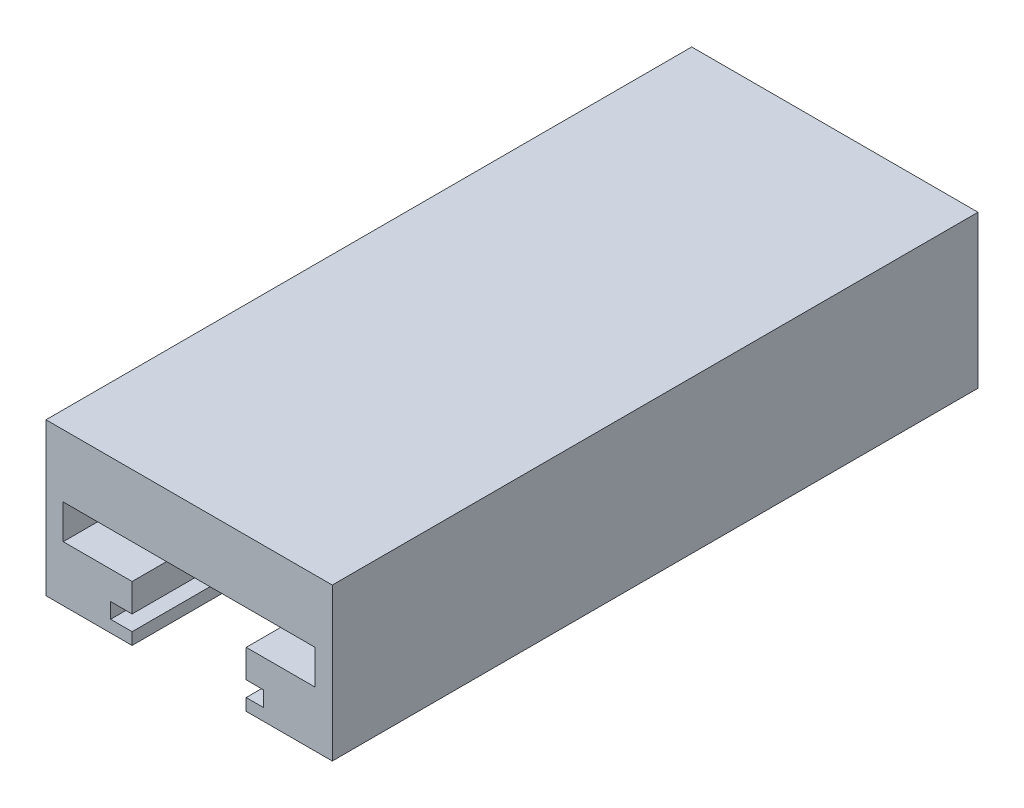
ISO-10303-21;
HEADER;
FILE_DESCRIPTION(('STEP AP214'),'2;1');
FILE_NAME('part.step','',(''),(''),'','','');
FILE_SCHEMA(('AUTOMOTIVE_DESIGN { 1 0 10303 214 1 1 1 1 }'));
ENDSEC;
DATA;
#1=APPLICATION_CONTEXT('core data for automotive mechanical design processes');
#2=APPLICATION_PROTOCOL_DEFINITION('international standard','automotive_design',2000,#1);
#3=PRODUCT_CONTEXT('',#1,'mechanical');
#4=PRODUCT('Part','Part','',(#3));
#5=PRODUCT_RELATED_PRODUCT_CATEGORY('part','',(#4));
#6=PRODUCT_DEFINITION_FORMATION('','',#4);
#7=PRODUCT_DEFINITION_CONTEXT('part definition',#1,'design');
#8=PRODUCT_DEFINITION('design','',#6,#7);
#9=PRODUCT_DEFINITION_SHAPE('','',#8);
#10=(LENGTH_UNIT() NAMED_UNIT(*) SI_UNIT(.MILLI.,.METRE.));
#11=(NAMED_UNIT(*) PLANE_ANGLE_UNIT() SI_UNIT($,.RADIAN.));
#12=(NAMED_UNIT(*) SI_UNIT($,.STERADIAN.) SOLID_ANGLE_UNIT());
#13=UNCERTAINTY_MEASURE_WITH_UNIT(LENGTH_MEASURE(1.E-05),#10,'distance_accuracy_value','');
#14=(GEOMETRIC_REPRESENTATION_CONTEXT(3) GLOBAL_UNCERTAINTY_ASSIGNED_CONTEXT((#13)) GLOBAL_UNIT_ASSIGNED_CONTEXT((#10,
#11,#12)) REPRESENTATION_CONTEXT('',''));
#15=CARTESIAN_POINT('',(0.,0.,0.));
#16=DIRECTION('',(0.,0.,1.));
#17=DIRECTION('',(1.,0.,0.));
#18=AXIS2_PLACEMENT_3D('',#15,#16,#17);
#19=CARTESIAN_POINT('',(9.99999999999999,14.5359639660174,75.));
#20=DIRECTION('',(-1.,0.,0.));
#21=DIRECTION('',(0.,-1.,0.));
#22=AXIS2_PLACEMENT_3D('',#19,#20,#21);
#23=PLANE('',#22);
#24=DIRECTION('',(0.,1.,0.));
#25=VECTOR('',#24,1.);
#26=CARTESIAN_POINT('',(9.99999999999999,14.5359639660174,0.));
#27=LINE('',#26,#25);
#28=CARTESIAN_POINT('',(10.,-3.16928090016898,0.));
#29=VERTEX_POINT('',#28);
#30=CARTESIAN_POINT('',(9.99999999999999,14.5359639660174,0.));
#31=VERTEX_POINT('',#30);
#32=EDGE_CURVE('E201',#29,#31,#27,.T.);
#33=ORIENTED_EDGE('',*,*,#32,.T.);
#34=DIRECTION('',(0.,0.,-1.));
#35=VECTOR('',#34,1.);
#36=CARTESIAN_POINT('',(9.99999999999999,14.5359639660174,75.));
#37=LINE('',#36,#35);
#38=CARTESIAN_POINT('',(9.99999999999999,14.5359639660174,75.));
#39=VERTEX_POINT('',#38);
#40=EDGE_CURVE('E11',#39,#31,#37,.T.);
#41=ORIENTED_EDGE('',*,*,#40,.F.);
#42=DIRECTION('',(0.,1.,0.));
#43=VECTOR('',#42,1.);
#44=CARTESIAN_POINT('',(9.99999999999999,14.5359639660174,75.));
#45=LINE('',#44,#43);
#46=CARTESIAN_POINT('',(10.,-3.16928090016898,75.));
#47=VERTEX_POINT('',#46);
#48=EDGE_CURVE('E240',#47,#39,#45,.T.);
#49=ORIENTED_EDGE('',*,*,#48,.F.);
#50=DIRECTION('',(0.,0.,-1.));
#51=VECTOR('',#50,1.);
#52=CARTESIAN_POINT('',(10.,-3.16928090016898,75.));
#53=LINE('',#52,#51);
#54=EDGE_CURVE('E197',#47,#29,#53,.T.);
#55=ORIENTED_EDGE('',*,*,#54,.T.);
#56=EDGE_LOOP('',(#33,#41,#49,#55));
#57=FACE_BOUND('',#56,.T.);
#58=ADVANCED_FACE('F33',(#57),#23,.F.);
#59=CARTESIAN_POINT('',(-23.25,14.5359639660174,75.));
#60=DIRECTION('',(0.,-1.,0.));
#61=DIRECTION('',(0.,0.,-1.));
#62=AXIS2_PLACEMENT_3D('',#59,#60,#61);
#63=PLANE('',#62);
#64=DIRECTION('',(-1.,0.,0.));
#65=VECTOR('',#64,1.);
#66=CARTESIAN_POINT('',(-23.25,14.5359639660174,0.));
#67=LINE('',#66,#65);
#68=CARTESIAN_POINT('',(-23.25,14.5359639660174,0.));
#69=VERTEX_POINT('',#68);
#70=EDGE_CURVE('E204',#31,#69,#67,.T.);
#71=ORIENTED_EDGE('',*,*,#70,.T.);
#72=DIRECTION('',(0.,0.,-1.));
#73=VECTOR('',#72,1.);
#74=CARTESIAN_POINT('',(-23.25,14.5359639660174,75.));
#75=LINE('',#74,#73);
#76=CARTESIAN_POINT('',(-23.25,14.5359639660174,75.));
#77=VERTEX_POINT('',#76);
#78=EDGE_CURVE('E41',#77,#69,#75,.T.);
#79=ORIENTED_EDGE('',*,*,#78,.F.);
#80=DIRECTION('',(-1.,0.,0.));
#81=VECTOR('',#80,1.);
#82=CARTESIAN_POINT('',(-23.25,14.5359639660174,75.));
#83=LINE('',#82,#81);
#84=EDGE_CURVE('E128',#39,#77,#83,.T.);
#85=ORIENTED_EDGE('',*,*,#84,.F.);
#86=ORIENTED_EDGE('',*,*,#40,.T.);
#87=EDGE_LOOP('',(#71,#79,#85,#86));
#88=FACE_BOUND('',#87,.T.);
#89=ADVANCED_FACE('F358',(#88),#63,.F.);
#90=CARTESIAN_POINT('',(-23.25,-3.16928090016899,75.));
#91=DIRECTION('',(1.,0.,0.));
#92=DIRECTION('',(0.,0.,-1.));
#93=AXIS2_PLACEMENT_3D('',#90,#91,#92);
#94=PLANE('',#93);
#95=DIRECTION('',(0.,-1.,0.));
#96=VECTOR('',#95,1.);
#97=CARTESIAN_POINT('',(-23.25,-3.16928090016899,0.));
#98=LINE('',#97,#96);
#99=CARTESIAN_POINT('',(-23.25,-3.16928090016899,0.));
#100=VERTEX_POINT('',#99);
#101=EDGE_CURVE('E206',#69,#100,#98,.T.);
#102=ORIENTED_EDGE('',*,*,#101,.T.);
#103=DIRECTION('',(0.,0.,-1.));
#104=VECTOR('',#103,1.);
#105=CARTESIAN_POINT('',(-23.25,-3.16928090016899,75.));
#106=LINE('',#105,#104);
#107=CARTESIAN_POINT('',(-23.25,-3.16928090016899,75.));
#108=VERTEX_POINT('',#107);
#109=EDGE_CURVE('E283',#108,#100,#106,.T.);
#110=ORIENTED_EDGE('',*,*,#109,.F.);
#111=DIRECTION('',(0.,-1.,0.));
#112=VECTOR('',#111,1.);
#113=CARTESIAN_POINT('',(-23.25,-3.16928090016899,75.));
#114=LINE('',#113,#112);
#115=EDGE_CURVE('E291',#77,#108,#114,.T.);
#116=ORIENTED_EDGE('',*,*,#115,.F.);
#117=ORIENTED_EDGE('',*,*,#78,.T.);
#118=EDGE_LOOP('',(#102,#110,#116,#117));
#119=FACE_BOUND('',#118,.T.);
#120=ADVANCED_FACE('F289',(#119),#94,.F.);
#121=CARTESIAN_POINT('',(-13.25,-3.16928090016899,75.));
#122=DIRECTION('',(0.,1.,0.));
#123=DIRECTION('',(-1.,0.,0.));
#124=AXIS2_PLACEMENT_3D('',#121,#122,#123);
#125=PLANE('',#124);
#126=DIRECTION('',(1.,0.,0.));
#127=VECTOR('',#126,1.);
#128=CARTESIAN_POINT('',(-13.25,-3.16928090016899,0.));
#129=LINE('',#128,#127);
#130=CARTESIAN_POINT('',(-13.25,-3.16928090016899,0.));
#131=VERTEX_POINT('',#130);
#132=EDGE_CURVE('E208',#100,#131,#129,.T.);
#133=ORIENTED_EDGE('',*,*,#132,.T.);
#134=DIRECTION('',(0.,0.,-1.));
#135=VECTOR('',#134,1.);
#136=CARTESIAN_POINT('',(-13.25,-3.16928090016899,75.));
#137=LINE('',#136,#135);
#138=CARTESIAN_POINT('',(-13.25,-3.16928090016899,75.));
#139=VERTEX_POINT('',#138);
#140=EDGE_CURVE('E280',#139,#131,#137,.T.);
#141=ORIENTED_EDGE('',*,*,#140,.F.);
#142=DIRECTION('',(1.,0.,0.));
#143=VECTOR('',#142,1.);
#144=CARTESIAN_POINT('',(-13.25,-3.16928090016899,75.));
#145=LINE('',#144,#143);
#146=EDGE_CURVE('E309',#108,#139,#145,.T.);
#147=ORIENTED_EDGE('',*,*,#146,.F.);
#148=ORIENTED_EDGE('',*,*,#109,.T.);
#149=EDGE_LOOP('',(#133,#141,#147,#148));
#150=FACE_BOUND('',#149,.T.);
#151=ADVANCED_FACE('F300',(#150),#125,.F.);
#152=CARTESIAN_POINT('',(-13.25,-1.78,75.));
#153=DIRECTION('',(-1.,0.,0.));
#154=DIRECTION('',(0.,0.,1.));
#155=AXIS2_PLACEMENT_3D('',#152,#153,#154);
#156=PLANE('',#155);
#157=DIRECTION('',(0.,1.,0.));
#158=VECTOR('',#157,1.);
#159=CARTESIAN_POINT('',(-13.25,-1.78,0.));
#160=LINE('',#159,#158);
#161=CARTESIAN_POINT('',(-13.25,-1.78,0.));
#162=VERTEX_POINT('',#161);
#163=EDGE_CURVE('E210',#131,#162,#160,.T.);
#164=ORIENTED_EDGE('',*,*,#163,.T.);
#165=DIRECTION('',(0.,0.,-1.));
#166=VECTOR('',#165,1.);
#167=CARTESIAN_POINT('',(-13.25,-1.78,75.));
#168=LINE('',#167,#166);
#169=CARTESIAN_POINT('',(-13.25,-1.78,75.));
#170=VERTEX_POINT('',#169);
#171=EDGE_CURVE('E277',#170,#162,#168,.T.);
#172=ORIENTED_EDGE('',*,*,#171,.F.);
#173=DIRECTION('',(0.,1.,0.));
#174=VECTOR('',#173,1.);
#175=CARTESIAN_POINT('',(-13.25,-1.78,75.));
#176=LINE('',#175,#174);
#177=EDGE_CURVE('E306',#139,#170,#176,.T.);
#178=ORIENTED_EDGE('',*,*,#177,.F.);
#179=ORIENTED_EDGE('',*,*,#140,.T.);
#180=EDGE_LOOP('',(#164,#172,#178,#179));
#181=FACE_BOUND('',#180,.T.);
#182=ADVANCED_FACE('F304',(#181),#156,.F.);
#183=CARTESIAN_POINT('',(-15.7464926107204,-1.78,75.));
#184=DIRECTION('',(0.,-1.,0.));
#185=DIRECTION('',(0.,0.,-1.));
#186=AXIS2_PLACEMENT_3D('',#183,#184,#185);
#187=PLANE('',#186);
#188=DIRECTION('',(-1.,0.,0.));
#189=VECTOR('',#188,1.);
#190=CARTESIAN_POINT('',(-15.7464926107204,-1.78,0.));
#191=LINE('',#190,#189);
#192=CARTESIAN_POINT('',(-15.7464926107204,-1.78,0.));
#193=VERTEX_POINT('',#192);
#194=EDGE_CURVE('E212',#162,#193,#191,.T.);
#195=ORIENTED_EDGE('',*,*,#194,.T.);
#196=DIRECTION('',(0.,0.,-1.));
#197=VECTOR('',#196,1.);
#198=CARTESIAN_POINT('',(-15.7464926107204,-1.78,75.));
#199=LINE('',#198,#197);
#200=CARTESIAN_POINT('',(-15.7464926107204,-1.78,75.));
#201=VERTEX_POINT('',#200);
#202=EDGE_CURVE('E274',#201,#193,#199,.T.);
#203=ORIENTED_EDGE('',*,*,#202,.F.);
#204=DIRECTION('',(-1.,0.,0.));
#205=VECTOR('',#204,1.);
#206=CARTESIAN_POINT('',(-15.7464926107204,-1.78,75.));
#207=LINE('',#206,#205);
#208=EDGE_CURVE('E308',#170,#201,#207,.T.);
#209=ORIENTED_EDGE('',*,*,#208,.F.);
#210=ORIENTED_EDGE('',*,*,#171,.T.);
#211=EDGE_LOOP('',(#195,#203,#209,#210));
#212=FACE_BOUND('',#211,.T.);
#213=ADVANCED_FACE('F371',(#212),#187,.F.);
#214=CARTESIAN_POINT('',(-15.7464926107204,0.,75.));
#215=DIRECTION('',(-1.,0.,0.));
#216=DIRECTION('',(0.,0.,1.));
#217=AXIS2_PLACEMENT_3D('',#214,#215,#216);
#218=PLANE('',#217);
#219=DIRECTION('',(0.,1.,0.));
#220=VECTOR('',#219,1.);
#221=CARTESIAN_POINT('',(-15.7464926107204,0.,0.));
#222=LINE('',#221,#220);
#223=CARTESIAN_POINT('',(-15.7464926107204,0.,0.));
#224=VERTEX_POINT('',#223);
#225=EDGE_CURVE('E214',#193,#224,#222,.T.);
#226=ORIENTED_EDGE('',*,*,#225,.T.);
#227=DIRECTION('',(0.,0.,-1.));
#228=VECTOR('',#227,1.);
#229=CARTESIAN_POINT('',(-15.7464926107204,0.,75.));
#230=LINE('',#229,#228);
#231=CARTESIAN_POINT('',(-15.7464926107204,0.,75.));
#232=VERTEX_POINT('',#231);
#233=EDGE_CURVE('E271',#232,#224,#230,.T.);
#234=ORIENTED_EDGE('',*,*,#233,.F.);
#235=DIRECTION('',(0.,1.,0.));
#236=VECTOR('',#235,1.);
#237=CARTESIAN_POINT('',(-15.7464926107204,0.,75.));
#238=LINE('',#237,#236);
#239=EDGE_CURVE('E311',#201,#232,#238,.T.);
#240=ORIENTED_EDGE('',*,*,#239,.F.);
#241=ORIENTED_EDGE('',*,*,#202,.T.);
#242=EDGE_LOOP('',(#226,#234,#240,#241));
#243=FACE_BOUND('',#242,.T.);
#244=ADVANCED_FACE('F374',(#243),#218,.F.);
#245=CARTESIAN_POINT('',(-13.25,0.,75.));
#246=DIRECTION('',(0.,1.,0.));
#247=DIRECTION('',(0.,0.,1.));
#248=AXIS2_PLACEMENT_3D('',#245,#246,#247);
#249=PLANE('',#248);
#250=DIRECTION('',(1.,0.,0.));
#251=VECTOR('',#250,1.);
#252=CARTESIAN_POINT('',(-13.25,0.,0.));
#253=LINE('',#252,#251);
#254=CARTESIAN_POINT('',(-13.25,0.,0.));
#255=VERTEX_POINT('',#254);
#256=EDGE_CURVE('E216',#224,#255,#253,.T.);
#257=ORIENTED_EDGE('',*,*,#256,.T.);
#258=DIRECTION('',(0.,0.,-1.));
#259=VECTOR('',#258,1.);
#260=CARTESIAN_POINT('',(-13.25,0.,75.));
#261=LINE('',#260,#259);
#262=CARTESIAN_POINT('',(-13.25,0.,75.));
#263=VERTEX_POINT('',#262);
#264=EDGE_CURVE('E268',#263,#255,#261,.T.);
#265=ORIENTED_EDGE('',*,*,#264,.F.);
#266=DIRECTION('',(1.,0.,0.));
#267=VECTOR('',#266,1.);
#268=CARTESIAN_POINT('',(-13.25,0.,75.));
#269=LINE('',#268,#267);
#270=EDGE_CURVE('E317',#232,#263,#269,.T.);
#271=ORIENTED_EDGE('',*,*,#270,.F.);
#272=ORIENTED_EDGE('',*,*,#233,.T.);
#273=EDGE_LOOP('',(#257,#265,#271,#272));
#274=FACE_BOUND('',#273,.T.);
#275=ADVANCED_FACE('F378',(#274),#249,.F.);
#276=CARTESIAN_POINT('',(-13.25,3.27,75.));
#277=DIRECTION('',(-1.,0.,0.));
#278=DIRECTION('',(0.,-1.,0.));
#279=AXIS2_PLACEMENT_3D('',#276,#277,#278);
#280=PLANE('',#279);
#281=DIRECTION('',(0.,1.,0.));
#282=VECTOR('',#281,1.);
#283=CARTESIAN_POINT('',(-13.25,3.27,0.));
#284=LINE('',#283,#282);
#285=CARTESIAN_POINT('',(-13.25,3.27,0.));
#286=VERTEX_POINT('',#285);
#287=EDGE_CURVE('E218',#255,#286,#284,.T.);
#288=ORIENTED_EDGE('',*,*,#287,.T.);
#289=DIRECTION('',(0.,0.,-1.));
#290=VECTOR('',#289,1.);
#291=CARTESIAN_POINT('',(-13.25,3.27,75.));
#292=LINE('',#291,#290);
#293=CARTESIAN_POINT('',(-13.25,3.27,75.));
#294=VERTEX_POINT('',#293);
#295=EDGE_CURVE('E265',#294,#286,#292,.T.);
#296=ORIENTED_EDGE('',*,*,#295,.F.);
#297=DIRECTION('',(0.,1.,0.));
#298=VECTOR('',#297,1.);
#299=CARTESIAN_POINT('',(-13.25,3.27,75.));
#300=LINE('',#299,#298);
#301=EDGE_CURVE('E319',#263,#294,#300,.T.);
#302=ORIENTED_EDGE('',*,*,#301,.F.);
#303=ORIENTED_EDGE('',*,*,#264,.T.);
#304=EDGE_LOOP('',(#288,#296,#302,#303));
#305=FACE_BOUND('',#304,.T.);
#306=ADVANCED_FACE('F382',(#305),#280,.F.);
#307=CARTESIAN_POINT('',(-21.25,3.27,75.));
#308=DIRECTION('',(0.,-1.,0.));
#309=DIRECTION('',(0.,0.,-1.));
#310=AXIS2_PLACEMENT_3D('',#307,#308,#309);
#311=PLANE('',#310);
#312=DIRECTION('',(-1.,0.,0.));
#313=VECTOR('',#312,1.);
#314=CARTESIAN_POINT('',(-21.25,3.27,0.));
#315=LINE('',#314,#313);
#316=CARTESIAN_POINT('',(-21.25,3.27,0.));
#317=VERTEX_POINT('',#316);
#318=EDGE_CURVE('E220',#286,#317,#315,.T.);
#319=ORIENTED_EDGE('',*,*,#318,.T.);
#320=DIRECTION('',(0.,0.,-1.));
#321=VECTOR('',#320,1.);
#322=CARTESIAN_POINT('',(-21.25,3.27,75.));
#323=LINE('',#322,#321);
#324=CARTESIAN_POINT('',(-21.25,3.27,75.));
#325=VERTEX_POINT('',#324);
#326=EDGE_CURVE('E262',#325,#317,#323,.T.);
#327=ORIENTED_EDGE('',*,*,#326,.F.);
#328=DIRECTION('',(-1.,0.,0.));
#329=VECTOR('',#328,1.);
#330=CARTESIAN_POINT('',(-21.25,3.27,75.));
#331=LINE('',#330,#329);
#332=EDGE_CURVE('E321',#294,#325,#331,.T.);
#333=ORIENTED_EDGE('',*,*,#332,.F.);
#334=ORIENTED_EDGE('',*,*,#295,.T.);
#335=EDGE_LOOP('',(#319,#327,#333,#334));
#336=FACE_BOUND('',#335,.T.);
#337=ADVANCED_FACE('F386',(#336),#311,.F.);
#338=CARTESIAN_POINT('',(-21.25,7.27,75.));
#339=DIRECTION('',(-1.,0.,0.));
#340=DIRECTION('',(0.,0.,1.));
#341=AXIS2_PLACEMENT_3D('',#338,#339,#340);
#342=PLANE('',#341);
#343=DIRECTION('',(0.,1.,0.));
#344=VECTOR('',#343,1.);
#345=CARTESIAN_POINT('',(-21.25,7.27,0.));
#346=LINE('',#345,#344);
#347=CARTESIAN_POINT('',(-21.25,7.27,0.));
#348=VERTEX_POINT('',#347);
#349=EDGE_CURVE('E222',#317,#348,#346,.T.);
#350=ORIENTED_EDGE('',*,*,#349,.T.);
#351=DIRECTION('',(0.,0.,-1.));
#352=VECTOR('',#351,1.);
#353=CARTESIAN_POINT('',(-21.25,7.27,75.));
#354=LINE('',#353,#352);
#355=CARTESIAN_POINT('',(-21.25,7.27,75.));
#356=VERTEX_POINT('',#355);
#357=EDGE_CURVE('E259',#356,#348,#354,.T.);
#358=ORIENTED_EDGE('',*,*,#357,.F.);
#359=DIRECTION('',(0.,1.,0.));
#360=VECTOR('',#359,1.);
#361=CARTESIAN_POINT('',(-21.25,7.27,75.));
#362=LINE('',#361,#360);
#363=EDGE_CURVE('E323',#325,#356,#362,.T.);
#364=ORIENTED_EDGE('',*,*,#363,.F.);
#365=ORIENTED_EDGE('',*,*,#326,.T.);
#366=EDGE_LOOP('',(#350,#358,#364,#365));
#367=FACE_BOUND('',#366,.T.);
#368=ADVANCED_FACE('F390',(#367),#342,.F.);
#369=CARTESIAN_POINT('',(8.,7.27,75.));
#370=DIRECTION('',(0.,1.,0.));
#371=DIRECTION('',(0.,0.,1.));
#372=AXIS2_PLACEMENT_3D('',#369,#370,#371);
#373=PLANE('',#372);
#374=DIRECTION('',(1.,0.,0.));
#375=VECTOR('',#374,1.);
#376=CARTESIAN_POINT('',(8.,7.27,0.));
#377=LINE('',#376,#375);
#378=CARTESIAN_POINT('',(8.,7.27,0.));
#379=VERTEX_POINT('',#378);
#380=EDGE_CURVE('E225',#348,#379,#377,.T.);
#381=ORIENTED_EDGE('',*,*,#380,.T.);
#382=DIRECTION('',(0.,0.,-1.));
#383=VECTOR('',#382,1.);
#384=CARTESIAN_POINT('',(8.,7.27,75.));
#385=LINE('',#384,#383);
#386=CARTESIAN_POINT('',(8.,7.27,75.));
#387=VERTEX_POINT('',#386);
#388=EDGE_CURVE('E256',#387,#379,#385,.T.);
#389=ORIENTED_EDGE('',*,*,#388,.F.);
#390=DIRECTION('',(1.,0.,0.));
#391=VECTOR('',#390,1.);
#392=CARTESIAN_POINT('',(-13.25,7.27,75.));
#393=LINE('',#392,#391);
#394=EDGE_CURVE('E325',#356,#387,#393,.T.);
#395=ORIENTED_EDGE('',*,*,#394,.F.);
#396=ORIENTED_EDGE('',*,*,#357,.T.);
#397=EDGE_LOOP('',(#381,#389,#395,#396));
#398=FACE_BOUND('',#397,.T.);
#399=ADVANCED_FACE('F394',(#398),#373,.F.);
#400=CARTESIAN_POINT('',(8.,3.27,75.));
#401=DIRECTION('',(1.,0.,0.));
#402=DIRECTION('',(0.,0.,-1.));
#403=AXIS2_PLACEMENT_3D('',#400,#401,#402);
#404=PLANE('',#403);
#405=DIRECTION('',(0.,-1.,0.));
#406=VECTOR('',#405,1.);
#407=CARTESIAN_POINT('',(8.,3.27,0.));
#408=LINE('',#407,#406);
#409=CARTESIAN_POINT('',(8.,3.27,0.));
#410=VERTEX_POINT('',#409);
#411=EDGE_CURVE('E227',#379,#410,#408,.T.);
#412=ORIENTED_EDGE('',*,*,#411,.T.);
#413=DIRECTION('',(0.,0.,-1.));
#414=VECTOR('',#413,1.);
#415=CARTESIAN_POINT('',(8.,3.27,75.));
#416=LINE('',#415,#414);
#417=CARTESIAN_POINT('',(8.,3.27,75.));
#418=VERTEX_POINT('',#417);
#419=EDGE_CURVE('E253',#418,#410,#416,.T.);
#420=ORIENTED_EDGE('',*,*,#419,.F.);
#421=DIRECTION('',(0.,-1.,0.));
#422=VECTOR('',#421,1.);
#423=CARTESIAN_POINT('',(8.,3.27,75.));
#424=LINE('',#423,#422);
#425=EDGE_CURVE('E327',#387,#418,#424,.T.);
#426=ORIENTED_EDGE('',*,*,#425,.F.);
#427=ORIENTED_EDGE('',*,*,#388,.T.);
#428=EDGE_LOOP('',(#412,#420,#426,#427));
#429=FACE_BOUND('',#428,.T.);
#430=ADVANCED_FACE('F398',(#429),#404,.F.);
#431=CARTESIAN_POINT('',(0.,3.27,75.));
#432=DIRECTION('',(0.,-1.,0.));
#433=DIRECTION('',(0.,0.,-1.));
#434=AXIS2_PLACEMENT_3D('',#431,#432,#433);
#435=PLANE('',#434);
#436=DIRECTION('',(-1.,0.,0.));
#437=VECTOR('',#436,1.);
#438=CARTESIAN_POINT('',(0.,3.27,0.));
#439=LINE('',#438,#437);
#440=CARTESIAN_POINT('',(0.,3.27,0.));
#441=VERTEX_POINT('',#440);
#442=EDGE_CURVE('E229',#410,#441,#439,.T.);
#443=ORIENTED_EDGE('',*,*,#442,.T.);
#444=DIRECTION('',(0.,0.,-1.));
#445=VECTOR('',#444,1.);
#446=CARTESIAN_POINT('',(0.,3.27,75.));
#447=LINE('',#446,#445);
#448=CARTESIAN_POINT('',(0.,3.27,75.));
#449=VERTEX_POINT('',#448);
#450=EDGE_CURVE('E250',#449,#441,#447,.T.);
#451=ORIENTED_EDGE('',*,*,#450,.F.);
#452=DIRECTION('',(-1.,0.,0.));
#453=VECTOR('',#452,1.);
#454=CARTESIAN_POINT('',(0.,3.27,75.));
#455=LINE('',#454,#453);
#456=EDGE_CURVE('E329',#418,#449,#455,.T.);
#457=ORIENTED_EDGE('',*,*,#456,.F.);
#458=ORIENTED_EDGE('',*,*,#419,.T.);
#459=EDGE_LOOP('',(#443,#451,#457,#458));
#460=FACE_BOUND('',#459,.T.);
#461=ADVANCED_FACE('F402',(#460),#435,.F.);
#462=CARTESIAN_POINT('',(0.,0.,75.));
#463=DIRECTION('',(1.,0.,0.));
#464=DIRECTION('',(0.,0.,-1.));
#465=AXIS2_PLACEMENT_3D('',#462,#463,#464);
#466=PLANE('',#465);
#467=DIRECTION('',(0.,-1.,0.));
#468=VECTOR('',#467,1.);
#469=CARTESIAN_POINT('',(0.,0.,0.));
#470=LINE('',#469,#468);
#471=CARTESIAN_POINT('',(0.,0.,0.));
#472=VERTEX_POINT('',#471);
#473=EDGE_CURVE('E231',#441,#472,#470,.T.);
#474=ORIENTED_EDGE('',*,*,#473,.T.);
#475=DIRECTION('',(0.,0.,-1.));
#476=VECTOR('',#475,1.);
#477=CARTESIAN_POINT('',(0.,0.,75.));
#478=LINE('',#477,#476);
#479=CARTESIAN_POINT('',(0.,0.,75.));
#480=VERTEX_POINT('',#479);
#481=EDGE_CURVE('E247',#480,#472,#478,.T.);
#482=ORIENTED_EDGE('',*,*,#481,.F.);
#483=DIRECTION('',(0.,-1.,0.));
#484=VECTOR('',#483,1.);
#485=CARTESIAN_POINT('',(0.,0.,75.));
#486=LINE('',#485,#484);
#487=EDGE_CURVE('E331',#449,#480,#486,.T.);
#488=ORIENTED_EDGE('',*,*,#487,.F.);
#489=ORIENTED_EDGE('',*,*,#450,.T.);
#490=EDGE_LOOP('',(#474,#482,#488,#489));
#491=FACE_BOUND('',#490,.T.);
#492=ADVANCED_FACE('F406',(#491),#466,.F.);
#493=CARTESIAN_POINT('',(2.,0.,75.));
#494=DIRECTION('',(0.,1.,0.));
#495=DIRECTION('',(-1.,0.,0.));
#496=AXIS2_PLACEMENT_3D('',#493,#494,#495);
#497=PLANE('',#496);
#498=DIRECTION('',(1.,0.,0.));
#499=VECTOR('',#498,1.);
#500=CARTESIAN_POINT('',(2.,0.,0.));
#501=LINE('',#500,#499);
#502=CARTESIAN_POINT('',(2.,0.,0.));
#503=VERTEX_POINT('',#502);
#504=EDGE_CURVE('E233',#472,#503,#501,.T.);
#505=ORIENTED_EDGE('',*,*,#504,.T.);
#506=DIRECTION('',(0.,0.,-1.));
#507=VECTOR('',#506,1.);
#508=CARTESIAN_POINT('',(2.,0.,75.));
#509=LINE('',#508,#507);
#510=CARTESIAN_POINT('',(2.,0.,75.));
#511=VERTEX_POINT('',#510);
#512=EDGE_CURVE('E244',#511,#503,#509,.T.);
#513=ORIENTED_EDGE('',*,*,#512,.F.);
#514=DIRECTION('',(1.,0.,0.));
#515=VECTOR('',#514,1.);
#516=CARTESIAN_POINT('',(2.,0.,75.));
#517=LINE('',#516,#515);
#518=EDGE_CURVE('E333',#480,#511,#517,.T.);
#519=ORIENTED_EDGE('',*,*,#518,.F.);
#520=ORIENTED_EDGE('',*,*,#481,.T.);
#521=EDGE_LOOP('',(#505,#513,#519,#520));
#522=FACE_BOUND('',#521,.T.);
#523=ADVANCED_FACE('F339',(#522),#497,.F.);
#524=CARTESIAN_POINT('',(2.,0.,75.));
#525=DIRECTION('',(1.,0.,0.));
#526=DIRECTION('',(0.,1.,0.));
#527=AXIS2_PLACEMENT_3D('',#524,#525,#526);
#528=PLANE('',#527);
#529=DIRECTION('',(0.,-1.,0.));
#530=VECTOR('',#529,1.);
#531=CARTESIAN_POINT('',(2.,0.,0.));
#532=LINE('',#531,#530);
#533=CARTESIAN_POINT('',(2.,-1.78,0.));
#534=VERTEX_POINT('',#533);
#535=EDGE_CURVE('E235',#503,#534,#532,.T.);
#536=ORIENTED_EDGE('',*,*,#535,.T.);
#537=DIRECTION('',(0.,0.,-1.));
#538=VECTOR('',#537,1.);
#539=CARTESIAN_POINT('',(2.,-1.78,75.));
#540=LINE('',#539,#538);
#541=CARTESIAN_POINT('',(2.,-1.78,75.));
#542=VERTEX_POINT('',#541);
#543=EDGE_CURVE('E192',#542,#534,#540,.T.);
#544=ORIENTED_EDGE('',*,*,#543,.F.);
#545=DIRECTION('',(0.,-1.,0.));
#546=VECTOR('',#545,1.);
#547=CARTESIAN_POINT('',(2.,0.,75.));
#548=LINE('',#547,#546);
#549=EDGE_CURVE('E183',#511,#542,#548,.T.);
#550=ORIENTED_EDGE('',*,*,#549,.F.);
#551=ORIENTED_EDGE('',*,*,#512,.T.);
#552=EDGE_LOOP('',(#536,#544,#550,#551));
#553=FACE_BOUND('',#552,.T.);
#554=ADVANCED_FACE('F343',(#553),#528,.F.);
#555=CARTESIAN_POINT('',(2.,-1.78,75.));
#556=DIRECTION('',(0.,-1.,0.));
#557=DIRECTION('',(1.,0.,0.));
#558=AXIS2_PLACEMENT_3D('',#555,#556,#557);
#559=PLANE('',#558);
#560=DIRECTION('',(-1.,0.,0.));
#561=VECTOR('',#560,1.);
#562=CARTESIAN_POINT('',(2.,-1.78,0.));
#563=LINE('',#562,#561);
#564=CARTESIAN_POINT('',(0.,-1.78,0.));
#565=VERTEX_POINT('',#564);
#566=EDGE_CURVE('E191',#534,#565,#563,.T.);
#567=ORIENTED_EDGE('',*,*,#566,.T.);
#568=DIRECTION('',(0.,0.,-1.));
#569=VECTOR('',#568,1.);
#570=CARTESIAN_POINT('',(0.,-1.78,75.));
#571=LINE('',#570,#569);
#572=CARTESIAN_POINT('',(0.,-1.78,75.));
#573=VERTEX_POINT('',#572);
#574=EDGE_CURVE('E188',#573,#565,#571,.T.);
#575=ORIENTED_EDGE('',*,*,#574,.F.);
#576=DIRECTION('',(-1.,0.,0.));
#577=VECTOR('',#576,1.);
#578=CARTESIAN_POINT('',(2.,-1.78,75.));
#579=LINE('',#578,#577);
#580=EDGE_CURVE('E177',#542,#573,#579,.T.);
#581=ORIENTED_EDGE('',*,*,#580,.F.);
#582=ORIENTED_EDGE('',*,*,#543,.T.);
#583=EDGE_LOOP('',(#567,#575,#581,#582));
#584=FACE_BOUND('',#583,.T.);
#585=ADVANCED_FACE('F189',(#584),#559,.F.);
#586=CARTESIAN_POINT('',(0.,-1.78,75.));
#587=DIRECTION('',(1.,0.,0.));
#588=DIRECTION('',(0.,1.,0.));
#589=AXIS2_PLACEMENT_3D('',#586,#587,#588);
#590=PLANE('',#589);
#591=DIRECTION('',(0.,-1.,0.));
#592=VECTOR('',#591,1.);
#593=CARTESIAN_POINT('',(0.,-1.78,0.));
#594=LINE('',#593,#592);
#595=CARTESIAN_POINT('',(0.,-3.16928090016898,0.));
#596=VERTEX_POINT('',#595);
#597=EDGE_CURVE('E114',#565,#596,#594,.T.);
#598=ORIENTED_EDGE('',*,*,#597,.T.);
#599=DIRECTION('',(0.,0.,-1.));
#600=VECTOR('',#599,1.);
#601=CARTESIAN_POINT('',(0.,-3.16928090016898,75.));
#602=LINE('',#601,#600);
#603=CARTESIAN_POINT('',(0.,-3.16928090016898,75.));
#604=VERTEX_POINT('',#603);
#605=EDGE_CURVE('E193',#604,#596,#602,.T.);
#606=ORIENTED_EDGE('',*,*,#605,.F.);
#607=DIRECTION('',(0.,-1.,0.));
#608=VECTOR('',#607,1.);
#609=CARTESIAN_POINT('',(0.,-1.78,75.));
#610=LINE('',#609,#608);
#611=EDGE_CURVE('E181',#573,#604,#610,.T.);
#612=ORIENTED_EDGE('',*,*,#611,.F.);
#613=ORIENTED_EDGE('',*,*,#574,.T.);
#614=EDGE_LOOP('',(#598,#606,#612,#613));
#615=FACE_BOUND('',#614,.T.);
#616=ADVANCED_FACE('F195',(#615),#590,.F.);
#617=CARTESIAN_POINT('',(10.,-3.16928090016898,75.));
#618=DIRECTION('',(0.,1.,0.));
#619=DIRECTION('',(-1.,0.,0.));
#620=AXIS2_PLACEMENT_3D('',#617,#618,#619);
#621=PLANE('',#620);
#622=DIRECTION('',(1.,0.,0.));
#623=VECTOR('',#622,1.);
#624=CARTESIAN_POINT('',(10.,-3.16928090016898,0.));
#625=LINE('',#624,#623);
#626=EDGE_CURVE('E120',#596,#29,#625,.T.);
#627=ORIENTED_EDGE('',*,*,#626,.T.);
#628=ORIENTED_EDGE('',*,*,#54,.F.);
#629=DIRECTION('',(1.,0.,0.));
#630=VECTOR('',#629,1.);
#631=CARTESIAN_POINT('',(10.,-3.16928090016898,75.));
#632=LINE('',#631,#630);
#633=EDGE_CURVE('E49',#604,#47,#632,.T.);
#634=ORIENTED_EDGE('',*,*,#633,.F.);
#635=ORIENTED_EDGE('',*,*,#605,.T.);
#636=EDGE_LOOP('',(#627,#628,#634,#635));
#637=FACE_BOUND('',#636,.T.);
#638=ADVANCED_FACE('F347',(#637),#621,.F.);
#639=CARTESIAN_POINT('',(0.,0.,75.));
#640=DIRECTION('',(0.,0.,-1.));
#641=DIRECTION('',(-1.,0.,0.));
#642=AXIS2_PLACEMENT_3D('',#639,#640,#641);
#643=PLANE('',#642);
#644=ORIENTED_EDGE('',*,*,#48,.T.);
#645=ORIENTED_EDGE('',*,*,#84,.T.);
#646=ORIENTED_EDGE('',*,*,#115,.T.);
#647=ORIENTED_EDGE('',*,*,#146,.T.);
#648=ORIENTED_EDGE('',*,*,#177,.T.);
#649=ORIENTED_EDGE('',*,*,#208,.T.);
#650=ORIENTED_EDGE('',*,*,#239,.T.);
#651=ORIENTED_EDGE('',*,*,#270,.T.);
#652=ORIENTED_EDGE('',*,*,#301,.T.);
#653=ORIENTED_EDGE('',*,*,#332,.T.);
#654=ORIENTED_EDGE('',*,*,#363,.T.);
#655=ORIENTED_EDGE('',*,*,#394,.T.);
#656=ORIENTED_EDGE('',*,*,#425,.T.);
#657=ORIENTED_EDGE('',*,*,#456,.T.);
#658=ORIENTED_EDGE('',*,*,#487,.T.);
#659=ORIENTED_EDGE('',*,*,#518,.T.);
#660=ORIENTED_EDGE('',*,*,#549,.T.);
#661=ORIENTED_EDGE('',*,*,#580,.T.);
#662=ORIENTED_EDGE('',*,*,#611,.T.);
#663=ORIENTED_EDGE('',*,*,#633,.T.);
#664=EDGE_LOOP('',(#644,#645,#646,#647,#648,#649,#650,#651,#652,#653,#654,#655,#656,#657,#658,
#659,#660,#661,#662,#663));
#665=FACE_BOUND('',#664,.T.);
#666=ADVANCED_FACE('F179',(#665),#643,.F.);
#667=CARTESIAN_POINT('',(0.,0.,0.));
#668=DIRECTION('',(0.,0.,-1.));
#669=DIRECTION('',(-1.,0.,0.));
#670=AXIS2_PLACEMENT_3D('',#667,#668,#669);
#671=PLANE('',#670);
#672=ORIENTED_EDGE('',*,*,#32,.F.);
#673=ORIENTED_EDGE('',*,*,#626,.F.);
#674=ORIENTED_EDGE('',*,*,#597,.F.);
#675=ORIENTED_EDGE('',*,*,#566,.F.);
#676=ORIENTED_EDGE('',*,*,#535,.F.);
#677=ORIENTED_EDGE('',*,*,#504,.F.);
#678=ORIENTED_EDGE('',*,*,#473,.F.);
#679=ORIENTED_EDGE('',*,*,#442,.F.);
#680=ORIENTED_EDGE('',*,*,#411,.F.);
#681=ORIENTED_EDGE('',*,*,#380,.F.);
#682=ORIENTED_EDGE('',*,*,#349,.F.);
#683=ORIENTED_EDGE('',*,*,#318,.F.);
#684=ORIENTED_EDGE('',*,*,#287,.F.);
#685=ORIENTED_EDGE('',*,*,#256,.F.);
#686=ORIENTED_EDGE('',*,*,#225,.F.);
#687=ORIENTED_EDGE('',*,*,#194,.F.);
#688=ORIENTED_EDGE('',*,*,#163,.F.);
#689=ORIENTED_EDGE('',*,*,#132,.F.);
#690=ORIENTED_EDGE('',*,*,#101,.F.);
#691=ORIENTED_EDGE('',*,*,#70,.F.);
#692=EDGE_LOOP('',(#672,#673,#674,#675,#676,#677,#678,#679,#680,#681,#682,#683,#684,#685,#686,
#687,#688,#689,#690,#691));
#693=FACE_BOUND('',#692,.T.);
#694=ADVANCED_FACE('F295',(#693),#671,.T.);
#695=CLOSED_SHELL('',(#58,#89,#120,#151,#182,#213,#244,#275,#306,#337,#368,#399,#430,#461,#492,
#523,#554,#585,#616,#638,#666,#694));
#696=MANIFOLD_SOLID_BREP('B2',#695);
#697=ADVANCED_BREP_SHAPE_REPRESENTATION('',(#18,#696),#14);
#698=SHAPE_DEFINITION_REPRESENTATION(#9,#697);
ENDSEC;
END-ISO-10303-21;
